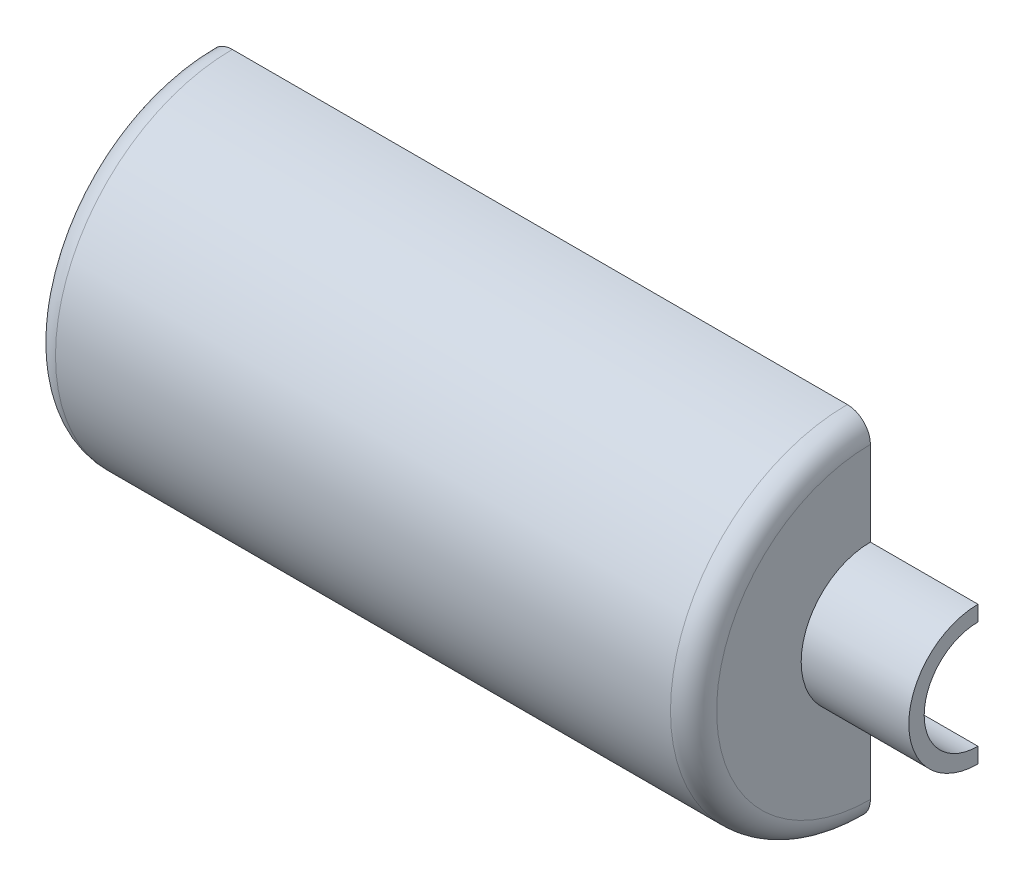
ISO-10303-21;
HEADER;
FILE_DESCRIPTION(('STEP AP214'),'2;1');
FILE_NAME('part.step','',(''),(''),'','','');
FILE_SCHEMA(('AUTOMOTIVE_DESIGN { 1 0 10303 214 1 1 1 1 }'));
ENDSEC;
DATA;
#1=APPLICATION_CONTEXT('core data for automotive mechanical design processes');
#2=APPLICATION_PROTOCOL_DEFINITION('international standard','automotive_design',2000,#1);
#3=PRODUCT_CONTEXT('',#1,'mechanical');
#4=PRODUCT('Part','Part','',(#3));
#5=PRODUCT_RELATED_PRODUCT_CATEGORY('part','',(#4));
#6=PRODUCT_DEFINITION_FORMATION('','',#4);
#7=PRODUCT_DEFINITION_CONTEXT('part definition',#1,'design');
#8=PRODUCT_DEFINITION('design','',#6,#7);
#9=PRODUCT_DEFINITION_SHAPE('','',#8);
#10=(LENGTH_UNIT() NAMED_UNIT(*) SI_UNIT(.MILLI.,.METRE.));
#11=(NAMED_UNIT(*) PLANE_ANGLE_UNIT() SI_UNIT($,.RADIAN.));
#12=(NAMED_UNIT(*) SI_UNIT($,.STERADIAN.) SOLID_ANGLE_UNIT());
#13=UNCERTAINTY_MEASURE_WITH_UNIT(LENGTH_MEASURE(1.E-05),#10,'distance_accuracy_value','');
#14=(GEOMETRIC_REPRESENTATION_CONTEXT(3) GLOBAL_UNCERTAINTY_ASSIGNED_CONTEXT((#13)) GLOBAL_UNIT_ASSIGNED_CONTEXT((#10,
#11,#12)) REPRESENTATION_CONTEXT('',''));
#15=CARTESIAN_POINT('',(0.,0.,0.));
#16=DIRECTION('',(0.,0.,1.));
#17=DIRECTION('',(1.,0.,0.));
#18=AXIS2_PLACEMENT_3D('',#15,#16,#17);
#19=CARTESIAN_POINT('',(-200.,0.,0.));
#20=DIRECTION('',(-1.,0.,0.));
#21=DIRECTION('',(0.,0.,1.));
#22=AXIS2_PLACEMENT_3D('',#19,#20,#21);
#23=PLANE('',#22);
#24=CARTESIAN_POINT('',(-200.,0.,0.));
#25=DIRECTION('',(-1.,0.,0.));
#26=DIRECTION('',(0.,0.,1.));
#27=AXIS2_PLACEMENT_3D('',#24,#25,#26);
#28=CIRCLE('',#27,92.5);
#29=CARTESIAN_POINT('',(-200.,-92.5,-6.45924047685979E-13));
#30=VERTEX_POINT('',#29);
#31=CARTESIAN_POINT('',(-200.,92.5,0.));
#32=VERTEX_POINT('',#31);
#33=EDGE_CURVE('E13',#30,#32,#28,.T.);
#34=ORIENTED_EDGE('',*,*,#33,.F.);
#35=DIRECTION('',(0.,-1.,0.));
#36=VECTOR('',#35,1.);
#37=CARTESIAN_POINT('',(-200.,0.,0.));
#38=LINE('',#37,#36);
#39=EDGE_CURVE('E137',#32,#30,#38,.T.);
#40=ORIENTED_EDGE('',*,*,#39,.F.);
#41=EDGE_LOOP('',(#34,#40));
#42=FACE_BOUND('',#41,.T.);
#43=ADVANCED_FACE('F47',(#42),#23,.F.);
#44=CARTESIAN_POINT('',(-192.5,0.,0.));
#45=DIRECTION('',(-1.,0.,0.));
#46=DIRECTION('',(0.,0.,1.));
#47=AXIS2_PLACEMENT_3D('',#44,#45,#46);
#48=TOROIDAL_SURFACE('',#47,92.5,7.50000000000001);
#49=CARTESIAN_POINT('',(-192.5,0.,0.));
#50=DIRECTION('',(-1.,0.,0.));
#51=DIRECTION('',(0.,0.,1.));
#52=AXIS2_PLACEMENT_3D('',#49,#50,#51);
#53=CIRCLE('',#52,100.);
#54=CARTESIAN_POINT('',(-192.5,-100.,-6.98296267768627E-13));
#55=VERTEX_POINT('',#54);
#56=CARTESIAN_POINT('',(-192.5,100.,0.));
#57=VERTEX_POINT('',#56);
#58=EDGE_CURVE('E54',#55,#57,#53,.T.);
#59=ORIENTED_EDGE('',*,*,#58,.F.);
#60=CARTESIAN_POINT('',(-192.5,-92.5,-6.4592404768598E-13));
#61=DIRECTION('',(0.,0.,1.));
#62=DIRECTION('',(1.,0.,0.));
#63=AXIS2_PLACEMENT_3D('',#60,#61,#62);
#64=CIRCLE('',#63,7.50000000000001);
#65=EDGE_CURVE('E142',#30,#55,#64,.T.);
#66=ORIENTED_EDGE('',*,*,#65,.F.);
#67=ORIENTED_EDGE('',*,*,#33,.T.);
#68=CARTESIAN_POINT('',(-192.5,92.5,0.));
#69=DIRECTION('',(0.,0.,-1.));
#70=DIRECTION('',(1.,0.,0.));
#71=AXIS2_PLACEMENT_3D('',#68,#69,#70);
#72=CIRCLE('',#71,7.50000000000001);
#73=EDGE_CURVE('E148',#32,#57,#72,.T.);
#74=ORIENTED_EDGE('',*,*,#73,.T.);
#75=EDGE_LOOP('',(#59,#66,#67,#74));
#76=FACE_BOUND('',#75,.T.);
#77=ADVANCED_FACE('F147',(#76),#48,.F.);
#78=CARTESIAN_POINT('',(0.,0.,0.));
#79=DIRECTION('',(-1.,0.,0.));
#80=DIRECTION('',(0.,0.,1.));
#81=AXIS2_PLACEMENT_3D('',#78,#79,#80);
#82=CYLINDRICAL_SURFACE('',#81,100.);
#83=CARTESIAN_POINT('',(192.5,0.,0.));
#84=DIRECTION('',(-1.,0.,0.));
#85=DIRECTION('',(0.,0.,1.));
#86=AXIS2_PLACEMENT_3D('',#83,#84,#85);
#87=CIRCLE('',#86,100.);
#88=CARTESIAN_POINT('',(192.5,-100.,-6.98296267768627E-13));
#89=VERTEX_POINT('',#88);
#90=CARTESIAN_POINT('',(192.5,100.,0.));
#91=VERTEX_POINT('',#90);
#92=EDGE_CURVE('E228',#89,#91,#87,.T.);
#93=ORIENTED_EDGE('',*,*,#92,.F.);
#94=DIRECTION('',(1.,0.,0.));
#95=VECTOR('',#94,1.);
#96=CARTESIAN_POINT('',(-192.5,-100.,-6.98296267768627E-13));
#97=LINE('',#96,#95);
#98=EDGE_CURVE('E182',#55,#89,#97,.T.);
#99=ORIENTED_EDGE('',*,*,#98,.F.);
#100=ORIENTED_EDGE('',*,*,#58,.T.);
#101=DIRECTION('',(1.,0.,0.));
#102=VECTOR('',#101,1.);
#103=CARTESIAN_POINT('',(-192.5,100.,0.));
#104=LINE('',#103,#102);
#105=EDGE_CURVE('E153',#57,#91,#104,.T.);
#106=ORIENTED_EDGE('',*,*,#105,.T.);
#107=EDGE_LOOP('',(#93,#99,#100,#106));
#108=FACE_BOUND('',#107,.T.);
#109=ADVANCED_FACE('F231',(#108),#82,.F.);
#110=CARTESIAN_POINT('',(192.5,0.,0.));
#111=DIRECTION('',(-1.,0.,0.));
#112=DIRECTION('',(0.,0.,1.));
#113=AXIS2_PLACEMENT_3D('',#110,#111,#112);
#114=TOROIDAL_SURFACE('',#113,92.5,7.50000000000001);
#115=CARTESIAN_POINT('',(200.,0.,0.));
#116=DIRECTION('',(-1.,0.,0.));
#117=DIRECTION('',(0.,0.,1.));
#118=AXIS2_PLACEMENT_3D('',#115,#116,#117);
#119=CIRCLE('',#118,92.5);
#120=CARTESIAN_POINT('',(200.,-92.5,-6.45924047685979E-13));
#121=VERTEX_POINT('',#120);
#122=CARTESIAN_POINT('',(200.,92.5,0.));
#123=VERTEX_POINT('',#122);
#124=EDGE_CURVE('E226',#121,#123,#119,.T.);
#125=ORIENTED_EDGE('',*,*,#124,.F.);
#126=CARTESIAN_POINT('',(192.5,-92.5,-6.4592404768598E-13));
#127=DIRECTION('',(0.,0.,1.));
#128=DIRECTION('',(1.,0.,0.));
#129=AXIS2_PLACEMENT_3D('',#126,#127,#128);
#130=CIRCLE('',#129,7.50000000000001);
#131=EDGE_CURVE('E185',#89,#121,#130,.T.);
#132=ORIENTED_EDGE('',*,*,#131,.F.);
#133=ORIENTED_EDGE('',*,*,#92,.T.);
#134=CARTESIAN_POINT('',(192.5,92.5,0.));
#135=DIRECTION('',(0.,0.,-1.));
#136=DIRECTION('',(1.,0.,0.));
#137=AXIS2_PLACEMENT_3D('',#134,#135,#136);
#138=CIRCLE('',#137,7.50000000000001);
#139=EDGE_CURVE('E155',#91,#123,#138,.T.);
#140=ORIENTED_EDGE('',*,*,#139,.T.);
#141=EDGE_LOOP('',(#125,#132,#133,#140));
#142=FACE_BOUND('',#141,.T.);
#143=ADVANCED_FACE('F235',(#142),#114,.F.);
#144=CARTESIAN_POINT('',(200.,-92.5,-6.45924047685979E-13));
#145=DIRECTION('',(1.,0.,0.));
#146=DIRECTION('',(0.,0.,-1.));
#147=AXIS2_PLACEMENT_3D('',#144,#145,#146);
#148=PLANE('',#147);
#149=CARTESIAN_POINT('',(200.,0.,0.));
#150=DIRECTION('',(-1.,0.,0.));
#151=DIRECTION('',(0.,0.,1.));
#152=AXIS2_PLACEMENT_3D('',#149,#150,#151);
#153=CIRCLE('',#152,35.);
#154=CARTESIAN_POINT('',(200.,-35.,-2.44403693719019E-13));
#155=VERTEX_POINT('',#154);
#156=CARTESIAN_POINT('',(200.,35.,0.));
#157=VERTEX_POINT('',#156);
#158=EDGE_CURVE('E224',#155,#157,#153,.T.);
#159=ORIENTED_EDGE('',*,*,#158,.F.);
#160=DIRECTION('',(0.,1.,0.));
#161=VECTOR('',#160,1.);
#162=CARTESIAN_POINT('',(200.,-92.5,-6.45924047685979E-13));
#163=LINE('',#162,#161);
#164=EDGE_CURVE('E188',#121,#155,#163,.T.);
#165=ORIENTED_EDGE('',*,*,#164,.F.);
#166=ORIENTED_EDGE('',*,*,#124,.T.);
#167=DIRECTION('',(0.,-1.,0.));
#168=VECTOR('',#167,1.);
#169=CARTESIAN_POINT('',(200.,92.5,0.));
#170=LINE('',#169,#168);
#171=EDGE_CURVE('E160',#123,#157,#170,.T.);
#172=ORIENTED_EDGE('',*,*,#171,.T.);
#173=EDGE_LOOP('',(#159,#165,#166,#172));
#174=FACE_BOUND('',#173,.T.);
#175=ADVANCED_FACE('F238',(#174),#148,.F.);
#176=CARTESIAN_POINT('',(0.,0.,0.));
#177=DIRECTION('',(-1.,0.,0.));
#178=DIRECTION('',(0.,0.,1.));
#179=AXIS2_PLACEMENT_3D('',#176,#177,#178);
#180=CYLINDRICAL_SURFACE('',#179,35.);
#181=CARTESIAN_POINT('',(285.,0.,0.));
#182=DIRECTION('',(-1.,0.,0.));
#183=DIRECTION('',(0.,0.,1.));
#184=AXIS2_PLACEMENT_3D('',#181,#182,#183);
#185=CIRCLE('',#184,35.);
#186=CARTESIAN_POINT('',(285.,-35.,-2.44403693719019E-13));
#187=VERTEX_POINT('',#186);
#188=CARTESIAN_POINT('',(285.,35.,0.));
#189=VERTEX_POINT('',#188);
#190=EDGE_CURVE('E222',#187,#189,#185,.T.);
#191=ORIENTED_EDGE('',*,*,#190,.F.);
#192=DIRECTION('',(1.,0.,0.));
#193=VECTOR('',#192,1.);
#194=CARTESIAN_POINT('',(200.,-35.,-2.44403693719019E-13));
#195=LINE('',#194,#193);
#196=EDGE_CURVE('E191',#155,#187,#195,.T.);
#197=ORIENTED_EDGE('',*,*,#196,.F.);
#198=ORIENTED_EDGE('',*,*,#158,.T.);
#199=DIRECTION('',(1.,0.,0.));
#200=VECTOR('',#199,1.);
#201=CARTESIAN_POINT('',(200.,35.,0.));
#202=LINE('',#201,#200);
#203=EDGE_CURVE('E163',#157,#189,#202,.T.);
#204=ORIENTED_EDGE('',*,*,#203,.T.);
#205=EDGE_LOOP('',(#191,#197,#198,#204));
#206=FACE_BOUND('',#205,.T.);
#207=ADVANCED_FACE('F243',(#206),#180,.F.);
#208=CARTESIAN_POINT('',(285.,-35.,-2.44403693719019E-13));
#209=DIRECTION('',(-1.,0.,0.));
#210=DIRECTION('',(0.,0.,1.));
#211=AXIS2_PLACEMENT_3D('',#208,#209,#210);
#212=PLANE('',#211);
#213=CARTESIAN_POINT('',(285.,0.,0.));
#214=DIRECTION('',(-1.,0.,0.));
#215=DIRECTION('',(0.,0.,1.));
#216=AXIS2_PLACEMENT_3D('',#213,#214,#215);
#217=CIRCLE('',#216,45.);
#218=CARTESIAN_POINT('',(285.,-45.,-3.14233320495882E-13));
#219=VERTEX_POINT('',#218);
#220=CARTESIAN_POINT('',(285.,45.,0.));
#221=VERTEX_POINT('',#220);
#222=EDGE_CURVE('E220',#219,#221,#217,.T.);
#223=ORIENTED_EDGE('',*,*,#222,.F.);
#224=DIRECTION('',(0.,-1.,0.));
#225=VECTOR('',#224,1.);
#226=CARTESIAN_POINT('',(285.,-35.,-2.44403693719019E-13));
#227=LINE('',#226,#225);
#228=EDGE_CURVE('E194',#187,#219,#227,.T.);
#229=ORIENTED_EDGE('',*,*,#228,.F.);
#230=ORIENTED_EDGE('',*,*,#190,.T.);
#231=DIRECTION('',(0.,1.,0.));
#232=VECTOR('',#231,1.);
#233=CARTESIAN_POINT('',(285.,35.,0.));
#234=LINE('',#233,#232);
#235=EDGE_CURVE('E166',#189,#221,#234,.T.);
#236=ORIENTED_EDGE('',*,*,#235,.T.);
#237=EDGE_LOOP('',(#223,#229,#230,#236));
#238=FACE_BOUND('',#237,.T.);
#239=ADVANCED_FACE('F246',(#238),#212,.F.);
#240=CARTESIAN_POINT('',(0.,0.,0.));
#241=DIRECTION('',(-1.,0.,0.));
#242=DIRECTION('',(0.,0.,1.));
#243=AXIS2_PLACEMENT_3D('',#240,#241,#242);
#244=CYLINDRICAL_SURFACE('',#243,45.);
#245=CARTESIAN_POINT('',(215.,0.,0.));
#246=DIRECTION('',(-1.,0.,0.));
#247=DIRECTION('',(0.,0.,1.));
#248=AXIS2_PLACEMENT_3D('',#245,#246,#247);
#249=CIRCLE('',#248,45.);
#250=CARTESIAN_POINT('',(215.,-45.,-3.14233320495882E-13));
#251=VERTEX_POINT('',#250);
#252=CARTESIAN_POINT('',(215.,45.,0.));
#253=VERTEX_POINT('',#252);
#254=EDGE_CURVE('E218',#251,#253,#249,.T.);
#255=ORIENTED_EDGE('',*,*,#254,.F.);
#256=DIRECTION('',(-1.,0.,0.));
#257=VECTOR('',#256,1.);
#258=CARTESIAN_POINT('',(215.,-45.,-3.14233320495882E-13));
#259=LINE('',#258,#257);
#260=EDGE_CURVE('E197',#219,#251,#259,.T.);
#261=ORIENTED_EDGE('',*,*,#260,.F.);
#262=ORIENTED_EDGE('',*,*,#222,.T.);
#263=DIRECTION('',(-1.,0.,0.));
#264=VECTOR('',#263,1.);
#265=CARTESIAN_POINT('',(215.,45.,0.));
#266=LINE('',#265,#264);
#267=EDGE_CURVE('E169',#221,#253,#266,.T.);
#268=ORIENTED_EDGE('',*,*,#267,.T.);
#269=EDGE_LOOP('',(#255,#261,#262,#268));
#270=FACE_BOUND('',#269,.T.);
#271=ADVANCED_FACE('F251',(#270),#244,.T.);
#272=CARTESIAN_POINT('',(215.,-99.9999999999999,-6.98296267768626E-13));
#273=DIRECTION('',(-1.,0.,0.));
#274=DIRECTION('',(0.,0.,1.));
#275=AXIS2_PLACEMENT_3D('',#272,#273,#274);
#276=PLANE('',#275);
#277=CARTESIAN_POINT('',(215.,0.,0.));
#278=DIRECTION('',(-1.,0.,0.));
#279=DIRECTION('',(0.,0.,1.));
#280=AXIS2_PLACEMENT_3D('',#277,#278,#279);
#281=CIRCLE('',#280,99.9999999999999);
#282=CARTESIAN_POINT('',(215.,-99.9999999999999,-6.98296267768626E-13));
#283=VERTEX_POINT('',#282);
#284=CARTESIAN_POINT('',(215.,99.9999999999999,0.));
#285=VERTEX_POINT('',#284);
#286=EDGE_CURVE('E216',#283,#285,#281,.T.);
#287=ORIENTED_EDGE('',*,*,#286,.F.);
#288=DIRECTION('',(0.,-1.,0.));
#289=VECTOR('',#288,1.);
#290=CARTESIAN_POINT('',(215.,-99.9999999999999,-6.98296267768626E-13));
#291=LINE('',#290,#289);
#292=EDGE_CURVE('E200',#251,#283,#291,.T.);
#293=ORIENTED_EDGE('',*,*,#292,.F.);
#294=ORIENTED_EDGE('',*,*,#254,.T.);
#295=DIRECTION('',(0.,1.,0.));
#296=VECTOR('',#295,1.);
#297=CARTESIAN_POINT('',(215.,99.9999999999999,0.));
#298=LINE('',#297,#296);
#299=EDGE_CURVE('E172',#253,#285,#298,.T.);
#300=ORIENTED_EDGE('',*,*,#299,.T.);
#301=EDGE_LOOP('',(#287,#293,#294,#300));
#302=FACE_BOUND('',#301,.T.);
#303=ADVANCED_FACE('F254',(#302),#276,.F.);
#304=CARTESIAN_POINT('',(200.,0.,0.));
#305=DIRECTION('',(-1.,0.,0.));
#306=DIRECTION('',(0.,0.,1.));
#307=AXIS2_PLACEMENT_3D('',#304,#305,#306);
#308=TOROIDAL_SURFACE('',#307,100.,15.);
#309=CARTESIAN_POINT('',(200.,0.,0.));
#310=DIRECTION('',(-1.,0.,0.));
#311=DIRECTION('',(0.,0.,1.));
#312=AXIS2_PLACEMENT_3D('',#309,#310,#311);
#313=CIRCLE('',#312,115.);
#314=CARTESIAN_POINT('',(200.,-115.,-8.03040707933921E-13));
#315=VERTEX_POINT('',#314);
#316=CARTESIAN_POINT('',(200.,115.,0.));
#317=VERTEX_POINT('',#316);
#318=EDGE_CURVE('E214',#315,#317,#313,.T.);
#319=ORIENTED_EDGE('',*,*,#318,.F.);
#320=CARTESIAN_POINT('',(200.,-100.,-6.98296267768627E-13));
#321=DIRECTION('',(0.,0.,-1.));
#322=DIRECTION('',(1.,0.,0.));
#323=AXIS2_PLACEMENT_3D('',#320,#321,#322);
#324=CIRCLE('',#323,15.);
#325=EDGE_CURVE('E203',#283,#315,#324,.T.);
#326=ORIENTED_EDGE('',*,*,#325,.F.);
#327=ORIENTED_EDGE('',*,*,#286,.T.);
#328=CARTESIAN_POINT('',(200.,100.,0.));
#329=DIRECTION('',(0.,0.,1.));
#330=DIRECTION('',(1.,0.,0.));
#331=AXIS2_PLACEMENT_3D('',#328,#329,#330);
#332=CIRCLE('',#331,15.);
#333=EDGE_CURVE('E175',#285,#317,#332,.T.);
#334=ORIENTED_EDGE('',*,*,#333,.T.);
#335=EDGE_LOOP('',(#319,#326,#327,#334));
#336=FACE_BOUND('',#335,.T.);
#337=ADVANCED_FACE('F258',(#336),#308,.T.);
#338=CARTESIAN_POINT('',(0.,0.,0.));
#339=DIRECTION('',(-1.,0.,0.));
#340=DIRECTION('',(0.,0.,1.));
#341=AXIS2_PLACEMENT_3D('',#338,#339,#340);
#342=CYLINDRICAL_SURFACE('',#341,115.);
#343=CARTESIAN_POINT('',(-200.,0.,0.));
#344=DIRECTION('',(-1.,0.,0.));
#345=DIRECTION('',(0.,0.,1.));
#346=AXIS2_PLACEMENT_3D('',#343,#344,#345);
#347=CIRCLE('',#346,115.);
#348=CARTESIAN_POINT('',(-200.,-115.,-8.03040707933921E-13));
#349=VERTEX_POINT('',#348);
#350=CARTESIAN_POINT('',(-200.,115.,0.));
#351=VERTEX_POINT('',#350);
#352=EDGE_CURVE('E69',#349,#351,#347,.T.);
#353=ORIENTED_EDGE('',*,*,#352,.F.);
#354=DIRECTION('',(-1.,0.,0.));
#355=VECTOR('',#354,1.);
#356=CARTESIAN_POINT('',(-200.,-115.,-8.03040707933921E-13));
#357=LINE('',#356,#355);
#358=EDGE_CURVE('E206',#315,#349,#357,.T.);
#359=ORIENTED_EDGE('',*,*,#358,.F.);
#360=ORIENTED_EDGE('',*,*,#318,.T.);
#361=DIRECTION('',(-1.,0.,0.));
#362=VECTOR('',#361,1.);
#363=CARTESIAN_POINT('',(-200.,115.,0.));
#364=LINE('',#363,#362);
#365=EDGE_CURVE('E178',#317,#351,#364,.T.);
#366=ORIENTED_EDGE('',*,*,#365,.T.);
#367=EDGE_LOOP('',(#353,#359,#360,#366));
#368=FACE_BOUND('',#367,.T.);
#369=ADVANCED_FACE('F260',(#368),#342,.T.);
#370=CARTESIAN_POINT('',(-200.,0.,0.));
#371=DIRECTION('',(-1.,0.,0.));
#372=DIRECTION('',(0.,0.,1.));
#373=AXIS2_PLACEMENT_3D('',#370,#371,#372);
#374=TOROIDAL_SURFACE('',#373,100.,15.);
#375=CARTESIAN_POINT('',(-215.,0.,0.));
#376=DIRECTION('',(-1.,0.,0.));
#377=DIRECTION('',(0.,0.,1.));
#378=AXIS2_PLACEMENT_3D('',#375,#376,#377);
#379=CIRCLE('',#378,99.9999999999999);
#380=CARTESIAN_POINT('',(-215.,-99.9999999999999,-6.98296267768626E-13));
#381=VERTEX_POINT('',#380);
#382=CARTESIAN_POINT('',(-215.,99.9999999999999,0.));
#383=VERTEX_POINT('',#382);
#384=EDGE_CURVE('E61',#381,#383,#379,.T.);
#385=ORIENTED_EDGE('',*,*,#384,.F.);
#386=CARTESIAN_POINT('',(-200.,-100.,-6.98296267768627E-13));
#387=DIRECTION('',(0.,0.,-1.));
#388=DIRECTION('',(-1.,0.,0.));
#389=AXIS2_PLACEMENT_3D('',#386,#387,#388);
#390=CIRCLE('',#389,15.);
#391=EDGE_CURVE('E208',#349,#381,#390,.T.);
#392=ORIENTED_EDGE('',*,*,#391,.F.);
#393=ORIENTED_EDGE('',*,*,#352,.T.);
#394=CARTESIAN_POINT('',(-200.,100.,0.));
#395=DIRECTION('',(0.,0.,1.));
#396=DIRECTION('',(-1.,0.,0.));
#397=AXIS2_PLACEMENT_3D('',#394,#395,#396);
#398=CIRCLE('',#397,15.);
#399=EDGE_CURVE('E143',#351,#383,#398,.T.);
#400=ORIENTED_EDGE('',*,*,#399,.T.);
#401=EDGE_LOOP('',(#385,#392,#393,#400));
#402=FACE_BOUND('',#401,.T.);
#403=ADVANCED_FACE('F263',(#402),#374,.T.);
#404=CARTESIAN_POINT('',(-215.,0.,0.));
#405=DIRECTION('',(1.,0.,0.));
#406=DIRECTION('',(0.,0.,-1.));
#407=AXIS2_PLACEMENT_3D('',#404,#405,#406);
#408=PLANE('',#407);
#409=DIRECTION('',(0.,1.,0.));
#410=VECTOR('',#409,1.);
#411=CARTESIAN_POINT('',(-215.,0.,0.));
#412=LINE('',#411,#410);
#413=EDGE_CURVE('E210',#381,#383,#412,.T.);
#414=ORIENTED_EDGE('',*,*,#413,.F.);
#415=ORIENTED_EDGE('',*,*,#384,.T.);
#416=EDGE_LOOP('',(#414,#415));
#417=FACE_BOUND('',#416,.T.);
#418=ADVANCED_FACE('F265',(#417),#408,.F.);
#419=CARTESIAN_POINT('',(-192.5,-92.5,-6.4592404768598E-13));
#420=DIRECTION('',(0.,0.,-1.));
#421=DIRECTION('',(1.,0.,0.));
#422=AXIS2_PLACEMENT_3D('',#419,#420,#421);
#423=PLANE('',#422);
#424=ORIENTED_EDGE('',*,*,#413,.T.);
#425=ORIENTED_EDGE('',*,*,#399,.F.);
#426=ORIENTED_EDGE('',*,*,#365,.F.);
#427=ORIENTED_EDGE('',*,*,#333,.F.);
#428=ORIENTED_EDGE('',*,*,#299,.F.);
#429=ORIENTED_EDGE('',*,*,#267,.F.);
#430=ORIENTED_EDGE('',*,*,#235,.F.);
#431=ORIENTED_EDGE('',*,*,#203,.F.);
#432=ORIENTED_EDGE('',*,*,#171,.F.);
#433=ORIENTED_EDGE('',*,*,#139,.F.);
#434=ORIENTED_EDGE('',*,*,#105,.F.);
#435=ORIENTED_EDGE('',*,*,#73,.F.);
#436=ORIENTED_EDGE('',*,*,#39,.T.);
#437=ORIENTED_EDGE('',*,*,#65,.T.);
#438=ORIENTED_EDGE('',*,*,#98,.T.);
#439=ORIENTED_EDGE('',*,*,#131,.T.);
#440=ORIENTED_EDGE('',*,*,#164,.T.);
#441=ORIENTED_EDGE('',*,*,#196,.T.);
#442=ORIENTED_EDGE('',*,*,#228,.T.);
#443=ORIENTED_EDGE('',*,*,#260,.T.);
#444=ORIENTED_EDGE('',*,*,#292,.T.);
#445=ORIENTED_EDGE('',*,*,#325,.T.);
#446=ORIENTED_EDGE('',*,*,#358,.T.);
#447=ORIENTED_EDGE('',*,*,#391,.T.);
#448=EDGE_LOOP('',(#424,#425,#426,#427,#428,#429,#430,#431,#432,#433,#434,#435,#436,#437,#438,
#439,#440,#441,#442,#443,#444,#445,#446,#447));
#449=FACE_BOUND('',#448,.T.);
#450=ADVANCED_FACE('F150',(#449),#423,.T.);
#451=CLOSED_SHELL('',(#43,#77,#109,#143,#175,#207,#239,#271,#303,#337,#369,#403,#418,#450));
#452=MANIFOLD_SOLID_BREP('B2',#451);
#453=ADVANCED_BREP_SHAPE_REPRESENTATION('',(#18,#452),#14);
#454=SHAPE_DEFINITION_REPRESENTATION(#9,#453);
ENDSEC;
END-ISO-10303-21;
